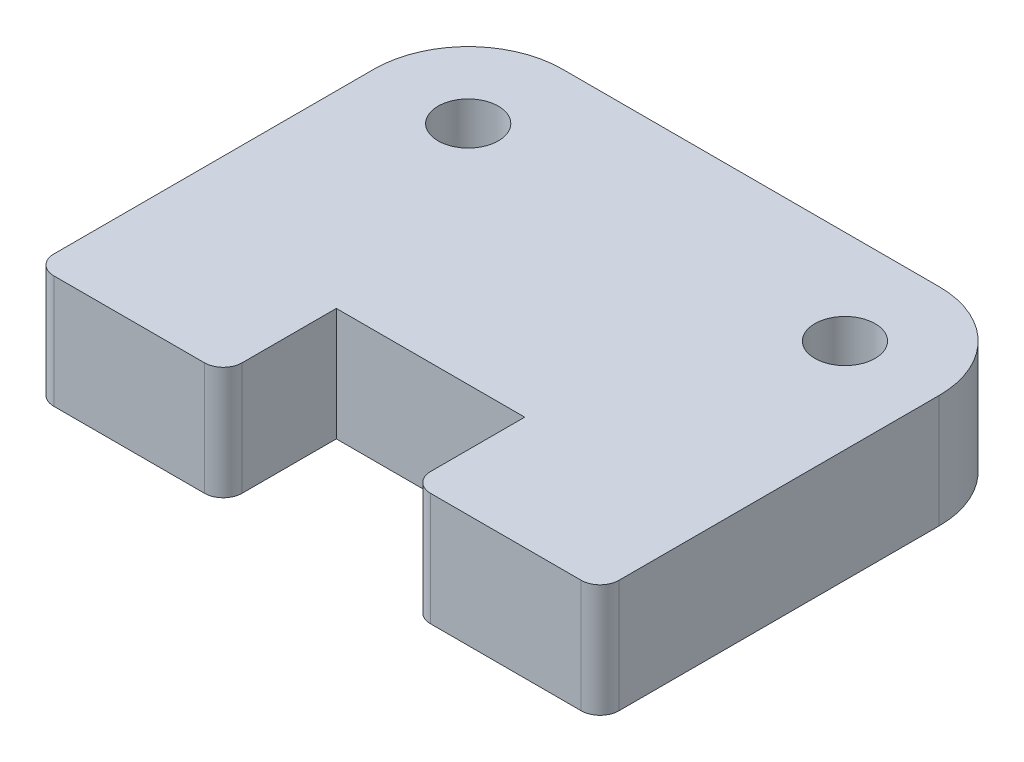
ISO-10303-21;
HEADER;
FILE_DESCRIPTION(('STEP AP214'),'2;1');
FILE_NAME('part.step','',(''),(''),'','','');
FILE_SCHEMA(('AUTOMOTIVE_DESIGN { 1 0 10303 214 1 1 1 1 }'));
ENDSEC;
DATA;
#1=APPLICATION_CONTEXT('core data for automotive mechanical design processes');
#2=APPLICATION_PROTOCOL_DEFINITION('international standard','automotive_design',2000,#1);
#3=PRODUCT_CONTEXT('',#1,'mechanical');
#4=PRODUCT('Part','Part','',(#3));
#5=PRODUCT_RELATED_PRODUCT_CATEGORY('part','',(#4));
#6=PRODUCT_DEFINITION_FORMATION('','',#4);
#7=PRODUCT_DEFINITION_CONTEXT('part definition',#1,'design');
#8=PRODUCT_DEFINITION('design','',#6,#7);
#9=PRODUCT_DEFINITION_SHAPE('','',#8);
#10=(LENGTH_UNIT() NAMED_UNIT(*) SI_UNIT(.MILLI.,.METRE.));
#11=(NAMED_UNIT(*) PLANE_ANGLE_UNIT() SI_UNIT($,.RADIAN.));
#12=(NAMED_UNIT(*) SI_UNIT($,.STERADIAN.) SOLID_ANGLE_UNIT());
#13=UNCERTAINTY_MEASURE_WITH_UNIT(LENGTH_MEASURE(1.E-05),#10,'distance_accuracy_value','');
#14=(GEOMETRIC_REPRESENTATION_CONTEXT(3) GLOBAL_UNCERTAINTY_ASSIGNED_CONTEXT((#13)) GLOBAL_UNIT_ASSIGNED_CONTEXT((#10,
#11,#12)) REPRESENTATION_CONTEXT('',''));
#15=CARTESIAN_POINT('',(0.,0.,0.));
#16=DIRECTION('',(0.,0.,1.));
#17=DIRECTION('',(1.,0.,0.));
#18=AXIS2_PLACEMENT_3D('',#15,#16,#17);
#19=CARTESIAN_POINT('',(0.,6.,0.));
#20=DIRECTION('',(0.,0.,-1.));
#21=DIRECTION('',(-1.,0.,0.));
#22=AXIS2_PLACEMENT_3D('',#19,#20,#21);
#23=PLANE('',#22);
#24=DIRECTION('',(0.,-1.,0.));
#25=VECTOR('',#24,1.);
#26=CARTESIAN_POINT('',(20.,6.,0.));
#27=LINE('',#26,#25);
#28=CARTESIAN_POINT('',(20.,6.,0.));
#29=VERTEX_POINT('',#28);
#30=CARTESIAN_POINT('',(20.,0.,0.));
#31=VERTEX_POINT('',#30);
#32=EDGE_CURVE('E156',#29,#31,#27,.T.);
#33=ORIENTED_EDGE('',*,*,#32,.F.);
#34=DIRECTION('',(1.,0.,0.));
#35=VECTOR('',#34,1.);
#36=CARTESIAN_POINT('',(0.,6.,0.));
#37=LINE('',#36,#35);
#38=CARTESIAN_POINT('',(10.,6.00000000000001,0.));
#39=VERTEX_POINT('',#38);
#40=EDGE_CURVE('E140',#39,#29,#37,.T.);
#41=ORIENTED_EDGE('',*,*,#40,.F.);
#42=DIRECTION('',(0.,1.,0.));
#43=VECTOR('',#42,1.);
#44=CARTESIAN_POINT('',(10.,6.00000000000001,0.));
#45=LINE('',#44,#43);
#46=CARTESIAN_POINT('',(10.,0.,0.));
#47=VERTEX_POINT('',#46);
#48=EDGE_CURVE('E153',#47,#39,#45,.T.);
#49=ORIENTED_EDGE('',*,*,#48,.F.);
#50=DIRECTION('',(1.,0.,0.));
#51=VECTOR('',#50,1.);
#52=CARTESIAN_POINT('',(0.,0.,0.));
#53=LINE('',#52,#51);
#54=EDGE_CURVE('E185',#47,#31,#53,.T.);
#55=ORIENTED_EDGE('',*,*,#54,.T.);
#56=EDGE_LOOP('',(#33,#41,#49,#55));
#57=FACE_BOUND('',#56,.T.);
#58=ADVANCED_FACE('F33',(#57),#23,.F.);
#59=CARTESIAN_POINT('',(0.,6.,0.));
#60=DIRECTION('',(1.,0.,0.));
#61=DIRECTION('',(0.,0.,-1.));
#62=AXIS2_PLACEMENT_3D('',#59,#60,#61);
#63=PLANE('',#62);
#64=DIRECTION('',(0.,0.,1.));
#65=VECTOR('',#64,1.);
#66=CARTESIAN_POINT('',(0.,6.,0.));
#67=LINE('',#66,#65);
#68=CARTESIAN_POINT('',(0.,6.,-12.));
#69=VERTEX_POINT('',#68);
#70=CARTESIAN_POINT('',(0.,6.,5.));
#71=VERTEX_POINT('',#70);
#72=EDGE_CURVE('E158',#69,#71,#67,.T.);
#73=ORIENTED_EDGE('',*,*,#72,.F.);
#74=DIRECTION('',(0.,-1.,0.));
#75=VECTOR('',#74,1.);
#76=CARTESIAN_POINT('',(0.,6.,-12.));
#77=LINE('',#76,#75);
#78=CARTESIAN_POINT('',(0.,0.,-12.));
#79=VERTEX_POINT('',#78);
#80=EDGE_CURVE('E11',#69,#79,#77,.T.);
#81=ORIENTED_EDGE('',*,*,#80,.T.);
#82=DIRECTION('',(0.,0.,1.));
#83=VECTOR('',#82,1.);
#84=CARTESIAN_POINT('',(0.,0.,0.));
#85=LINE('',#84,#83);
#86=CARTESIAN_POINT('',(0.,0.,5.));
#87=VERTEX_POINT('',#86);
#88=EDGE_CURVE('E146',#79,#87,#85,.T.);
#89=ORIENTED_EDGE('',*,*,#88,.T.);
#90=DIRECTION('',(0.,-1.,0.));
#91=VECTOR('',#90,1.);
#92=CARTESIAN_POINT('',(0.,6.00000000000001,5.));
#93=LINE('',#92,#91);
#94=EDGE_CURVE('E476',#87,#71,#93,.F.);
#95=ORIENTED_EDGE('',*,*,#94,.T.);
#96=EDGE_LOOP('',(#73,#81,#89,#95));
#97=FACE_BOUND('',#96,.T.);
#98=ADVANCED_FACE('F302',(#97),#63,.F.);
#99=CARTESIAN_POINT('',(30.,6.,0.));
#100=DIRECTION('',(-1.,0.,0.));
#101=DIRECTION('',(0.,0.,1.));
#102=AXIS2_PLACEMENT_3D('',#99,#100,#101);
#103=PLANE('',#102);
#104=DIRECTION('',(0.,0.,-1.));
#105=VECTOR('',#104,1.);
#106=CARTESIAN_POINT('',(30.,0.,0.));
#107=LINE('',#106,#105);
#108=CARTESIAN_POINT('',(30.,0.,5.));
#109=VERTEX_POINT('',#108);
#110=CARTESIAN_POINT('',(30.,0.,-12.));
#111=VERTEX_POINT('',#110);
#112=EDGE_CURVE('E188',#109,#111,#107,.T.);
#113=ORIENTED_EDGE('',*,*,#112,.T.);
#114=DIRECTION('',(0.,-1.,0.));
#115=VECTOR('',#114,1.);
#116=CARTESIAN_POINT('',(30.,6.,-12.));
#117=LINE('',#116,#115);
#118=CARTESIAN_POINT('',(30.,6.,-12.));
#119=VERTEX_POINT('',#118);
#120=EDGE_CURVE('E56',#111,#119,#117,.F.);
#121=ORIENTED_EDGE('',*,*,#120,.T.);
#122=DIRECTION('',(0.,0.,-1.));
#123=VECTOR('',#122,1.);
#124=CARTESIAN_POINT('',(30.,6.,0.));
#125=LINE('',#124,#123);
#126=CARTESIAN_POINT('',(30.,6.,5.));
#127=VERTEX_POINT('',#126);
#128=EDGE_CURVE('E157',#127,#119,#125,.T.);
#129=ORIENTED_EDGE('',*,*,#128,.F.);
#130=DIRECTION('',(0.,1.,0.));
#131=VECTOR('',#130,1.);
#132=CARTESIAN_POINT('',(30.,0.,5.));
#133=LINE('',#132,#131);
#134=EDGE_CURVE('E207',#127,#109,#133,.F.);
#135=ORIENTED_EDGE('',*,*,#134,.T.);
#136=EDGE_LOOP('',(#113,#121,#129,#135));
#137=FACE_BOUND('',#136,.T.);
#138=ADVANCED_FACE('F298',(#137),#103,.F.);
#139=CARTESIAN_POINT('',(0.,6.,-17.));
#140=DIRECTION('',(0.,0.,1.));
#141=DIRECTION('',(1.,0.,0.));
#142=AXIS2_PLACEMENT_3D('',#139,#140,#141);
#143=PLANE('',#142);
#144=DIRECTION('',(-1.,0.,0.));
#145=VECTOR('',#144,1.);
#146=CARTESIAN_POINT('',(0.,6.,-17.));
#147=LINE('',#146,#145);
#148=CARTESIAN_POINT('',(25.,6.,-17.));
#149=VERTEX_POINT('',#148);
#150=CARTESIAN_POINT('',(5.,6.,-17.));
#151=VERTEX_POINT('',#150);
#152=EDGE_CURVE('E220',#149,#151,#147,.T.);
#153=ORIENTED_EDGE('',*,*,#152,.F.);
#154=DIRECTION('',(0.,-1.,0.));
#155=VECTOR('',#154,1.);
#156=CARTESIAN_POINT('',(25.,6.,-17.));
#157=LINE('',#156,#155);
#158=CARTESIAN_POINT('',(25.,0.,-17.));
#159=VERTEX_POINT('',#158);
#160=EDGE_CURVE('E202',#149,#159,#157,.T.);
#161=ORIENTED_EDGE('',*,*,#160,.T.);
#162=DIRECTION('',(-1.,0.,0.));
#163=VECTOR('',#162,1.);
#164=CARTESIAN_POINT('',(0.,0.,-17.));
#165=LINE('',#164,#163);
#166=CARTESIAN_POINT('',(5.,0.,-17.));
#167=VERTEX_POINT('',#166);
#168=EDGE_CURVE('E180',#159,#167,#165,.T.);
#169=ORIENTED_EDGE('',*,*,#168,.T.);
#170=DIRECTION('',(0.,-1.,0.));
#171=VECTOR('',#170,1.);
#172=CARTESIAN_POINT('',(5.,6.,-17.));
#173=LINE('',#172,#171);
#174=EDGE_CURVE('E200',#167,#151,#173,.F.);
#175=ORIENTED_EDGE('',*,*,#174,.T.);
#176=EDGE_LOOP('',(#153,#161,#169,#175));
#177=FACE_BOUND('',#176,.T.);
#178=ADVANCED_FACE('F199',(#177),#143,.F.);
#179=CARTESIAN_POINT('',(0.,6.,0.));
#180=DIRECTION('',(0.,-1.,0.));
#181=DIRECTION('',(0.,0.,-1.));
#182=AXIS2_PLACEMENT_3D('',#179,#180,#181);
#183=PLANE('',#182);
#184=CARTESIAN_POINT('',(5.,6.,-12.));
#185=DIRECTION('',(0.,1.,0.));
#186=DIRECTION('',(0.,0.,1.));
#187=AXIS2_PLACEMENT_3D('',#184,#185,#186);
#188=CIRCLE('',#187,1.59999999999999);
#189=CARTESIAN_POINT('',(5.,6.,-10.4));
#190=VERTEX_POINT('',#189);
#191=EDGE_CURVE('E272',#190,#190,#188,.T.);
#192=ORIENTED_EDGE('',*,*,#191,.F.);
#193=EDGE_LOOP('',(#192));
#194=FACE_BOUND('',#193,.T.);
#195=CARTESIAN_POINT('',(25.,6.,-12.));
#196=DIRECTION('',(0.,1.,0.));
#197=DIRECTION('',(0.,0.,1.));
#198=AXIS2_PLACEMENT_3D('',#195,#196,#197);
#199=CIRCLE('',#198,1.59999999999999);
#200=CARTESIAN_POINT('',(25.,6.,-10.4));
#201=VERTEX_POINT('',#200);
#202=EDGE_CURVE('E269',#201,#201,#199,.T.);
#203=ORIENTED_EDGE('',*,*,#202,.F.);
#204=EDGE_LOOP('',(#203));
#205=FACE_BOUND('',#204,.T.);
#206=ORIENTED_EDGE('',*,*,#128,.T.);
#207=CARTESIAN_POINT('',(25.,6.,-12.));
#208=DIRECTION('',(0.,-1.,0.));
#209=DIRECTION('',(0.,0.,-1.));
#210=AXIS2_PLACEMENT_3D('',#207,#208,#209);
#211=CIRCLE('',#210,5.);
#212=EDGE_CURVE('E41',#119,#149,#211,.F.);
#213=ORIENTED_EDGE('',*,*,#212,.T.);
#214=ORIENTED_EDGE('',*,*,#152,.T.);
#215=CARTESIAN_POINT('',(5.,6.,-12.));
#216=DIRECTION('',(0.,-1.,0.));
#217=DIRECTION('',(0.,0.,-1.));
#218=AXIS2_PLACEMENT_3D('',#215,#216,#217);
#219=CIRCLE('',#218,5.);
#220=EDGE_CURVE('E48',#151,#69,#219,.F.);
#221=ORIENTED_EDGE('',*,*,#220,.T.);
#222=ORIENTED_EDGE('',*,*,#72,.T.);
#223=CARTESIAN_POINT('',(1.,6.,5.));
#224=DIRECTION('',(0.,-1.,0.));
#225=DIRECTION('',(0.,0.,-1.));
#226=AXIS2_PLACEMENT_3D('',#223,#224,#225);
#227=CIRCLE('',#226,1.);
#228=CARTESIAN_POINT('',(1.,6.00000000000001,6.));
#229=VERTEX_POINT('',#228);
#230=EDGE_CURVE('E467',#71,#229,#227,.F.);
#231=ORIENTED_EDGE('',*,*,#230,.T.);
#232=DIRECTION('',(-1.,0.,0.));
#233=VECTOR('',#232,1.);
#234=CARTESIAN_POINT('',(0.,6.00000000000001,6.));
#235=LINE('',#234,#233);
#236=CARTESIAN_POINT('',(9.,6.00000000000001,6.));
#237=VERTEX_POINT('',#236);
#238=EDGE_CURVE('E162',#237,#229,#235,.T.);
#239=ORIENTED_EDGE('',*,*,#238,.F.);
#240=CARTESIAN_POINT('',(9.,6.,5.));
#241=DIRECTION('',(0.,-1.,0.));
#242=DIRECTION('',(0.,0.,-1.));
#243=AXIS2_PLACEMENT_3D('',#240,#241,#242);
#244=CIRCLE('',#243,1.);
#245=CARTESIAN_POINT('',(10.,6.00000000000001,5.));
#246=VERTEX_POINT('',#245);
#247=EDGE_CURVE('E142',#237,#246,#244,.F.);
#248=ORIENTED_EDGE('',*,*,#247,.T.);
#249=DIRECTION('',(0.,0.,-1.));
#250=VECTOR('',#249,1.);
#251=CARTESIAN_POINT('',(10.,6.00000000000001,6.));
#252=LINE('',#251,#250);
#253=EDGE_CURVE('E136',#246,#39,#252,.T.);
#254=ORIENTED_EDGE('',*,*,#253,.T.);
#255=ORIENTED_EDGE('',*,*,#40,.T.);
#256=DIRECTION('',(0.,0.,-1.));
#257=VECTOR('',#256,1.);
#258=CARTESIAN_POINT('',(20.,6.,6.));
#259=LINE('',#258,#257);
#260=CARTESIAN_POINT('',(20.,6.,5.));
#261=VERTEX_POINT('',#260);
#262=EDGE_CURVE('E163',#261,#29,#259,.T.);
#263=ORIENTED_EDGE('',*,*,#262,.F.);
#264=CARTESIAN_POINT('',(21.,6.,5.));
#265=DIRECTION('',(0.,-1.,0.));
#266=DIRECTION('',(0.,0.,-1.));
#267=AXIS2_PLACEMENT_3D('',#264,#265,#266);
#268=CIRCLE('',#267,1.);
#269=CARTESIAN_POINT('',(21.,6.,6.));
#270=VERTEX_POINT('',#269);
#271=EDGE_CURVE('E210',#261,#270,#268,.F.);
#272=ORIENTED_EDGE('',*,*,#271,.T.);
#273=DIRECTION('',(-1.,0.,0.));
#274=VECTOR('',#273,1.);
#275=CARTESIAN_POINT('',(20.,6.,6.));
#276=LINE('',#275,#274);
#277=CARTESIAN_POINT('',(29.,6.,6.));
#278=VERTEX_POINT('',#277);
#279=EDGE_CURVE('E250',#278,#270,#276,.T.);
#280=ORIENTED_EDGE('',*,*,#279,.F.);
#281=CARTESIAN_POINT('',(29.,6.,5.));
#282=DIRECTION('',(0.,-1.,0.));
#283=DIRECTION('',(0.,0.,-1.));
#284=AXIS2_PLACEMENT_3D('',#281,#282,#283);
#285=CIRCLE('',#284,1.);
#286=EDGE_CURVE('E245',#278,#127,#285,.F.);
#287=ORIENTED_EDGE('',*,*,#286,.T.);
#288=EDGE_LOOP('',(#206,#213,#214,#221,#222,#231,#239,#248,#254,#255,#263,#272,#280,#287));
#289=FACE_BOUND('',#288,.T.);
#290=ADVANCED_FACE('F138',(#194,#205,#289),#183,.F.);
#291=CARTESIAN_POINT('',(0.,0.,0.));
#292=DIRECTION('',(0.,-1.,0.));
#293=DIRECTION('',(0.,0.,-1.));
#294=AXIS2_PLACEMENT_3D('',#291,#292,#293);
#295=PLANE('',#294);
#296=CARTESIAN_POINT('',(5.,0.,-12.));
#297=DIRECTION('',(0.,-1.,0.));
#298=DIRECTION('',(0.,0.,-1.));
#299=AXIS2_PLACEMENT_3D('',#296,#297,#298);
#300=CIRCLE('',#299,1.59999999999999);
#301=CARTESIAN_POINT('',(5.,0.,-13.6));
#302=VERTEX_POINT('',#301);
#303=EDGE_CURVE('E213',#302,#302,#300,.T.);
#304=ORIENTED_EDGE('',*,*,#303,.F.);
#305=EDGE_LOOP('',(#304));
#306=FACE_BOUND('',#305,.T.);
#307=CARTESIAN_POINT('',(25.,0.,-12.));
#308=DIRECTION('',(0.,-1.,0.));
#309=DIRECTION('',(0.,0.,-1.));
#310=AXIS2_PLACEMENT_3D('',#307,#308,#309);
#311=CIRCLE('',#310,1.59999999999999);
#312=CARTESIAN_POINT('',(25.,0.,-13.6));
#313=VERTEX_POINT('',#312);
#314=EDGE_CURVE('E265',#313,#313,#311,.T.);
#315=ORIENTED_EDGE('',*,*,#314,.F.);
#316=EDGE_LOOP('',(#315));
#317=FACE_BOUND('',#316,.T.);
#318=ORIENTED_EDGE('',*,*,#168,.F.);
#319=CARTESIAN_POINT('',(25.,0.,-12.));
#320=DIRECTION('',(0.,-1.,0.));
#321=DIRECTION('',(0.,0.,-1.));
#322=AXIS2_PLACEMENT_3D('',#319,#320,#321);
#323=CIRCLE('',#322,5.);
#324=EDGE_CURVE('E216',#159,#111,#323,.T.);
#325=ORIENTED_EDGE('',*,*,#324,.T.);
#326=ORIENTED_EDGE('',*,*,#112,.F.);
#327=CARTESIAN_POINT('',(29.,0.,5.));
#328=DIRECTION('',(0.,-1.,0.));
#329=DIRECTION('',(0.,0.,-1.));
#330=AXIS2_PLACEMENT_3D('',#327,#328,#329);
#331=CIRCLE('',#330,1.);
#332=CARTESIAN_POINT('',(29.,0.,6.));
#333=VERTEX_POINT('',#332);
#334=EDGE_CURVE('E227',#109,#333,#331,.T.);
#335=ORIENTED_EDGE('',*,*,#334,.T.);
#336=DIRECTION('',(1.,0.,0.));
#337=VECTOR('',#336,1.);
#338=CARTESIAN_POINT('',(20.,0.,6.));
#339=LINE('',#338,#337);
#340=CARTESIAN_POINT('',(21.,0.,6.));
#341=VERTEX_POINT('',#340);
#342=EDGE_CURVE('E256',#341,#333,#339,.T.);
#343=ORIENTED_EDGE('',*,*,#342,.F.);
#344=CARTESIAN_POINT('',(21.,0.,5.));
#345=DIRECTION('',(0.,-1.,0.));
#346=DIRECTION('',(0.,0.,-1.));
#347=AXIS2_PLACEMENT_3D('',#344,#345,#346);
#348=CIRCLE('',#347,1.);
#349=CARTESIAN_POINT('',(20.,0.,5.));
#350=VERTEX_POINT('',#349);
#351=EDGE_CURVE('E235',#341,#350,#348,.T.);
#352=ORIENTED_EDGE('',*,*,#351,.T.);
#353=DIRECTION('',(0.,0.,-1.));
#354=VECTOR('',#353,1.);
#355=CARTESIAN_POINT('',(20.,0.,6.));
#356=LINE('',#355,#354);
#357=EDGE_CURVE('E168',#350,#31,#356,.T.);
#358=ORIENTED_EDGE('',*,*,#357,.T.);
#359=ORIENTED_EDGE('',*,*,#54,.F.);
#360=DIRECTION('',(0.,0.,-1.));
#361=VECTOR('',#360,1.);
#362=CARTESIAN_POINT('',(10.,0.,6.));
#363=LINE('',#362,#361);
#364=CARTESIAN_POINT('',(10.,0.,5.));
#365=VERTEX_POINT('',#364);
#366=EDGE_CURVE('E147',#365,#47,#363,.T.);
#367=ORIENTED_EDGE('',*,*,#366,.F.);
#368=CARTESIAN_POINT('',(9.,0.,5.));
#369=DIRECTION('',(0.,-1.,0.));
#370=DIRECTION('',(0.,0.,-1.));
#371=AXIS2_PLACEMENT_3D('',#368,#369,#370);
#372=CIRCLE('',#371,1.);
#373=CARTESIAN_POINT('',(9.,0.,6.));
#374=VERTEX_POINT('',#373);
#375=EDGE_CURVE('E470',#365,#374,#372,.T.);
#376=ORIENTED_EDGE('',*,*,#375,.T.);
#377=DIRECTION('',(1.,0.,0.));
#378=VECTOR('',#377,1.);
#379=CARTESIAN_POINT('',(0.,0.,6.));
#380=LINE('',#379,#378);
#381=CARTESIAN_POINT('',(1.,0.,6.));
#382=VERTEX_POINT('',#381);
#383=EDGE_CURVE('E166',#382,#374,#380,.T.);
#384=ORIENTED_EDGE('',*,*,#383,.F.);
#385=CARTESIAN_POINT('',(1.,0.,5.));
#386=DIRECTION('',(0.,-1.,0.));
#387=DIRECTION('',(0.,0.,-1.));
#388=AXIS2_PLACEMENT_3D('',#385,#386,#387);
#389=CIRCLE('',#388,1.);
#390=EDGE_CURVE('E469',#382,#87,#389,.T.);
#391=ORIENTED_EDGE('',*,*,#390,.T.);
#392=ORIENTED_EDGE('',*,*,#88,.F.);
#393=CARTESIAN_POINT('',(5.,0.,-12.));
#394=DIRECTION('',(0.,-1.,0.));
#395=DIRECTION('',(0.,0.,-1.));
#396=AXIS2_PLACEMENT_3D('',#393,#394,#395);
#397=CIRCLE('',#396,5.);
#398=EDGE_CURVE('E206',#79,#167,#397,.T.);
#399=ORIENTED_EDGE('',*,*,#398,.T.);
#400=EDGE_LOOP('',(#318,#325,#326,#335,#343,#352,#358,#359,#367,#376,#384,#391,#392,#399));
#401=FACE_BOUND('',#400,.T.);
#402=ADVANCED_FACE('F224',(#306,#317,#401),#295,.T.);
#403=CARTESIAN_POINT('',(10.,6.00000000000001,6.));
#404=DIRECTION('',(-1.,0.,0.));
#405=DIRECTION('',(0.,0.,1.));
#406=AXIS2_PLACEMENT_3D('',#403,#404,#405);
#407=PLANE('',#406);
#408=ORIENTED_EDGE('',*,*,#253,.F.);
#409=DIRECTION('',(0.,1.,0.));
#410=VECTOR('',#409,1.);
#411=CARTESIAN_POINT('',(10.,0.,5.));
#412=LINE('',#411,#410);
#413=EDGE_CURVE('E481',#246,#365,#412,.F.);
#414=ORIENTED_EDGE('',*,*,#413,.T.);
#415=ORIENTED_EDGE('',*,*,#366,.T.);
#416=ORIENTED_EDGE('',*,*,#48,.T.);
#417=EDGE_LOOP('',(#408,#414,#415,#416));
#418=FACE_BOUND('',#417,.T.);
#419=ADVANCED_FACE('F160',(#418),#407,.F.);
#420=CARTESIAN_POINT('',(0.,0.,6.));
#421=DIRECTION('',(0.,0.,1.));
#422=DIRECTION('',(1.,0.,0.));
#423=AXIS2_PLACEMENT_3D('',#420,#421,#422);
#424=PLANE('',#423);
#425=ORIENTED_EDGE('',*,*,#238,.T.);
#426=DIRECTION('',(0.,-1.,0.));
#427=VECTOR('',#426,1.);
#428=CARTESIAN_POINT('',(1.,0.,6.));
#429=LINE('',#428,#427);
#430=EDGE_CURVE('E462',#229,#382,#429,.T.);
#431=ORIENTED_EDGE('',*,*,#430,.T.);
#432=ORIENTED_EDGE('',*,*,#383,.T.);
#433=DIRECTION('',(0.,1.,0.));
#434=VECTOR('',#433,1.);
#435=CARTESIAN_POINT('',(9.,6.00000000000001,6.));
#436=LINE('',#435,#434);
#437=EDGE_CURVE('E222',#374,#237,#436,.T.);
#438=ORIENTED_EDGE('',*,*,#437,.T.);
#439=EDGE_LOOP('',(#425,#431,#432,#438));
#440=FACE_BOUND('',#439,.T.);
#441=ADVANCED_FACE('F315',(#440),#424,.T.);
#442=CARTESIAN_POINT('',(1.,0.,5.));
#443=DIRECTION('',(0.,1.,0.));
#444=DIRECTION('',(0.,0.,1.));
#445=AXIS2_PLACEMENT_3D('',#442,#443,#444);
#446=CYLINDRICAL_SURFACE('',#445,1.);
#447=ORIENTED_EDGE('',*,*,#230,.F.);
#448=ORIENTED_EDGE('',*,*,#94,.F.);
#449=ORIENTED_EDGE('',*,*,#390,.F.);
#450=ORIENTED_EDGE('',*,*,#430,.F.);
#451=EDGE_LOOP('',(#447,#448,#449,#450));
#452=FACE_BOUND('',#451,.T.);
#453=ADVANCED_FACE('F311',(#452),#446,.T.);
#454=CARTESIAN_POINT('',(9.,0.,5.));
#455=DIRECTION('',(0.,-1.,0.));
#456=DIRECTION('',(0.,0.,-1.));
#457=AXIS2_PLACEMENT_3D('',#454,#455,#456);
#458=CYLINDRICAL_SURFACE('',#457,1.);
#459=ORIENTED_EDGE('',*,*,#375,.F.);
#460=ORIENTED_EDGE('',*,*,#413,.F.);
#461=ORIENTED_EDGE('',*,*,#247,.F.);
#462=ORIENTED_EDGE('',*,*,#437,.F.);
#463=EDGE_LOOP('',(#459,#460,#461,#462));
#464=FACE_BOUND('',#463,.T.);
#465=ADVANCED_FACE('F314',(#464),#458,.T.);
#466=CARTESIAN_POINT('',(20.,6.,6.));
#467=DIRECTION('',(1.,0.,0.));
#468=DIRECTION('',(0.,1.,0.));
#469=AXIS2_PLACEMENT_3D('',#466,#467,#468);
#470=PLANE('',#469);
#471=ORIENTED_EDGE('',*,*,#357,.F.);
#472=DIRECTION('',(0.,-1.,0.));
#473=VECTOR('',#472,1.);
#474=CARTESIAN_POINT('',(20.,6.,5.));
#475=LINE('',#474,#473);
#476=EDGE_CURVE('E238',#350,#261,#475,.F.);
#477=ORIENTED_EDGE('',*,*,#476,.T.);
#478=ORIENTED_EDGE('',*,*,#262,.T.);
#479=ORIENTED_EDGE('',*,*,#32,.T.);
#480=EDGE_LOOP('',(#471,#477,#478,#479));
#481=FACE_BOUND('',#480,.T.);
#482=ADVANCED_FACE('F261',(#481),#470,.F.);
#483=CARTESIAN_POINT('',(0.,0.,6.));
#484=DIRECTION('',(0.,0.,1.));
#485=DIRECTION('',(1.,0.,0.));
#486=AXIS2_PLACEMENT_3D('',#483,#484,#485);
#487=PLANE('',#486);
#488=ORIENTED_EDGE('',*,*,#279,.T.);
#489=DIRECTION('',(0.,-1.,0.));
#490=VECTOR('',#489,1.);
#491=CARTESIAN_POINT('',(21.,0.,6.));
#492=LINE('',#491,#490);
#493=EDGE_CURVE('E236',#270,#341,#492,.T.);
#494=ORIENTED_EDGE('',*,*,#493,.T.);
#495=ORIENTED_EDGE('',*,*,#342,.T.);
#496=DIRECTION('',(0.,1.,0.));
#497=VECTOR('',#496,1.);
#498=CARTESIAN_POINT('',(29.,6.,6.));
#499=LINE('',#498,#497);
#500=EDGE_CURVE('E234',#333,#278,#499,.T.);
#501=ORIENTED_EDGE('',*,*,#500,.T.);
#502=EDGE_LOOP('',(#488,#494,#495,#501));
#503=FACE_BOUND('',#502,.T.);
#504=ADVANCED_FACE('F255',(#503),#487,.T.);
#505=CARTESIAN_POINT('',(21.,0.,5.));
#506=DIRECTION('',(0.,1.,0.));
#507=DIRECTION('',(-1.,0.,0.));
#508=AXIS2_PLACEMENT_3D('',#505,#506,#507);
#509=CYLINDRICAL_SURFACE('',#508,1.);
#510=ORIENTED_EDGE('',*,*,#271,.F.);
#511=ORIENTED_EDGE('',*,*,#476,.F.);
#512=ORIENTED_EDGE('',*,*,#351,.F.);
#513=ORIENTED_EDGE('',*,*,#493,.F.);
#514=EDGE_LOOP('',(#510,#511,#512,#513));
#515=FACE_BOUND('',#514,.T.);
#516=ADVANCED_FACE('F258',(#515),#509,.T.);
#517=CARTESIAN_POINT('',(29.,0.,5.));
#518=DIRECTION('',(0.,-1.,0.));
#519=DIRECTION('',(0.,0.,-1.));
#520=AXIS2_PLACEMENT_3D('',#517,#518,#519);
#521=CYLINDRICAL_SURFACE('',#520,1.);
#522=ORIENTED_EDGE('',*,*,#334,.F.);
#523=ORIENTED_EDGE('',*,*,#134,.F.);
#524=ORIENTED_EDGE('',*,*,#286,.F.);
#525=ORIENTED_EDGE('',*,*,#500,.F.);
#526=EDGE_LOOP('',(#522,#523,#524,#525));
#527=FACE_BOUND('',#526,.T.);
#528=ADVANCED_FACE('F232',(#527),#521,.T.);
#529=CARTESIAN_POINT('',(25.,6.,-12.));
#530=DIRECTION('',(0.,1.,0.));
#531=DIRECTION('',(0.,0.,1.));
#532=AXIS2_PLACEMENT_3D('',#529,#530,#531);
#533=CYLINDRICAL_SURFACE('',#532,1.59999999999999);
#534=ORIENTED_EDGE('',*,*,#314,.T.);
#535=EDGE_LOOP('',(#534));
#536=FACE_BOUND('',#535,.T.);
#537=ORIENTED_EDGE('',*,*,#202,.T.);
#538=EDGE_LOOP('',(#537));
#539=FACE_BOUND('',#538,.T.);
#540=ADVANCED_FACE('F286',(#536,#539),#533,.F.);
#541=CARTESIAN_POINT('',(5.,6.,-12.));
#542=DIRECTION('',(0.,1.,0.));
#543=DIRECTION('',(0.,0.,1.));
#544=AXIS2_PLACEMENT_3D('',#541,#542,#543);
#545=CYLINDRICAL_SURFACE('',#544,1.59999999999999);
#546=ORIENTED_EDGE('',*,*,#303,.T.);
#547=EDGE_LOOP('',(#546));
#548=FACE_BOUND('',#547,.T.);
#549=ORIENTED_EDGE('',*,*,#191,.T.);
#550=EDGE_LOOP('',(#549));
#551=FACE_BOUND('',#550,.T.);
#552=ADVANCED_FACE('F279',(#548,#551),#545,.F.);
#553=CARTESIAN_POINT('',(25.,6.,-12.));
#554=DIRECTION('',(0.,-1.,0.));
#555=DIRECTION('',(0.,0.,-1.));
#556=AXIS2_PLACEMENT_3D('',#553,#554,#555);
#557=CYLINDRICAL_SURFACE('',#556,5.);
#558=ORIENTED_EDGE('',*,*,#212,.F.);
#559=ORIENTED_EDGE('',*,*,#120,.F.);
#560=ORIENTED_EDGE('',*,*,#324,.F.);
#561=ORIENTED_EDGE('',*,*,#160,.F.);
#562=EDGE_LOOP('',(#558,#559,#560,#561));
#563=FACE_BOUND('',#562,.T.);
#564=ADVANCED_FACE('F223',(#563),#557,.T.);
#565=CARTESIAN_POINT('',(5.,6.,-12.));
#566=DIRECTION('',(0.,-1.,0.));
#567=DIRECTION('',(0.,0.,-1.));
#568=AXIS2_PLACEMENT_3D('',#565,#566,#567);
#569=CYLINDRICAL_SURFACE('',#568,5.);
#570=ORIENTED_EDGE('',*,*,#220,.F.);
#571=ORIENTED_EDGE('',*,*,#174,.F.);
#572=ORIENTED_EDGE('',*,*,#398,.F.);
#573=ORIENTED_EDGE('',*,*,#80,.F.);
#574=EDGE_LOOP('',(#570,#571,#572,#573));
#575=FACE_BOUND('',#574,.T.);
#576=ADVANCED_FACE('F35',(#575),#569,.T.);
#577=CLOSED_SHELL('',(#58,#98,#138,#178,#290,#402,#419,#441,#453,#465,#482,#504,#516,#528,#540,
#552,#564,#576));
#578=MANIFOLD_SOLID_BREP('B2',#577);
#579=ADVANCED_BREP_SHAPE_REPRESENTATION('',(#18,#578),#14);
#580=SHAPE_DEFINITION_REPRESENTATION(#9,#579);
ENDSEC;
END-ISO-10303-21;
